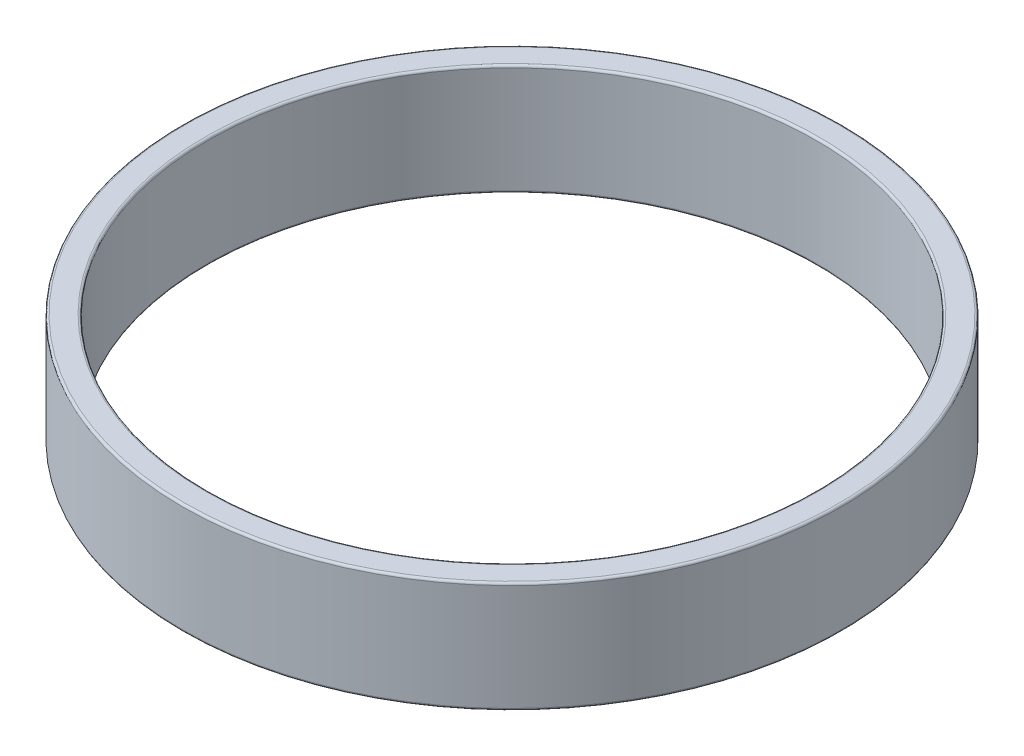
ISO-10303-21;
HEADER;
FILE_DESCRIPTION(('STEP AP214'),'2;1');
FILE_NAME('part.step','',(''),(''),'','','');
FILE_SCHEMA(('AUTOMOTIVE_DESIGN { 1 0 10303 214 1 1 1 1 }'));
ENDSEC;
DATA;
#1=APPLICATION_CONTEXT('core data for automotive mechanical design processes');
#2=APPLICATION_PROTOCOL_DEFINITION('international standard','automotive_design',2000,#1);
#3=PRODUCT_CONTEXT('',#1,'mechanical');
#4=PRODUCT('Part','Part','',(#3));
#5=PRODUCT_RELATED_PRODUCT_CATEGORY('part','',(#4));
#6=PRODUCT_DEFINITION_FORMATION('','',#4);
#7=PRODUCT_DEFINITION_CONTEXT('part definition',#1,'design');
#8=PRODUCT_DEFINITION('design','',#6,#7);
#9=PRODUCT_DEFINITION_SHAPE('','',#8);
#10=(LENGTH_UNIT() NAMED_UNIT(*) SI_UNIT(.MILLI.,.METRE.));
#11=(NAMED_UNIT(*) PLANE_ANGLE_UNIT() SI_UNIT($,.RADIAN.));
#12=(NAMED_UNIT(*) SI_UNIT($,.STERADIAN.) SOLID_ANGLE_UNIT());
#13=UNCERTAINTY_MEASURE_WITH_UNIT(LENGTH_MEASURE(1.E-05),#10,'distance_accuracy_value','');
#14=(GEOMETRIC_REPRESENTATION_CONTEXT(3) GLOBAL_UNCERTAINTY_ASSIGNED_CONTEXT((#13)) GLOBAL_UNIT_ASSIGNED_CONTEXT((#10,
#11,#12)) REPRESENTATION_CONTEXT('',''));
#15=CARTESIAN_POINT('',(0.,0.,0.));
#16=DIRECTION('',(0.,0.,1.));
#17=DIRECTION('',(1.,0.,0.));
#18=AXIS2_PLACEMENT_3D('',#15,#16,#17);
#19=CARTESIAN_POINT('',(0.,25.4,0.));
#20=DIRECTION('',(0.,1.,0.));
#21=DIRECTION('',(0.,0.,1.));
#22=AXIS2_PLACEMENT_3D('',#19,#20,#21);
#23=PLANE('',#22);
#24=CARTESIAN_POINT('',(0.,25.4,0.));
#25=DIRECTION('',(0.,1.,0.));
#26=DIRECTION('',(0.,0.,1.));
#27=AXIS2_PLACEMENT_3D('',#24,#25,#26);
#28=CIRCLE('',#27,70.358);
#29=CARTESIAN_POINT('',(0.,25.4,70.358));
#30=VERTEX_POINT('',#29);
#31=EDGE_CURVE('E42',#30,#30,#28,.F.);
#32=ORIENTED_EDGE('',*,*,#31,.T.);
#33=EDGE_LOOP('',(#32));
#34=FACE_BOUND('',#33,.T.);
#35=CARTESIAN_POINT('',(0.,25.4,0.));
#36=DIRECTION('',(0.,1.,0.));
#37=DIRECTION('',(0.,0.,1.));
#38=AXIS2_PLACEMENT_3D('',#35,#36,#37);
#39=CIRCLE('',#38,75.057);
#40=CARTESIAN_POINT('',(0.,25.4,75.057));
#41=VERTEX_POINT('',#40);
#42=EDGE_CURVE('E46',#41,#41,#39,.T.);
#43=ORIENTED_EDGE('',*,*,#42,.T.);
#44=EDGE_LOOP('',(#43));
#45=FACE_BOUND('',#44,.T.);
#46=ADVANCED_FACE('F31',(#34,#45),#23,.T.);
#47=CARTESIAN_POINT('',(0.,0.,0.));
#48=DIRECTION('',(0.,1.,0.));
#49=DIRECTION('',(0.,0.,1.));
#50=AXIS2_PLACEMENT_3D('',#47,#48,#49);
#51=PLANE('',#50);
#52=CARTESIAN_POINT('',(0.,0.,0.));
#53=DIRECTION('',(0.,1.,0.));
#54=DIRECTION('',(0.,0.,1.));
#55=AXIS2_PLACEMENT_3D('',#52,#53,#54);
#56=CIRCLE('',#55,70.358);
#57=CARTESIAN_POINT('',(0.,0.,70.358));
#58=VERTEX_POINT('',#57);
#59=EDGE_CURVE('E57',#58,#58,#56,.T.);
#60=ORIENTED_EDGE('',*,*,#59,.T.);
#61=EDGE_LOOP('',(#60));
#62=FACE_BOUND('',#61,.T.);
#63=CARTESIAN_POINT('',(0.,0.,0.));
#64=DIRECTION('',(0.,1.,0.));
#65=DIRECTION('',(0.,0.,1.));
#66=AXIS2_PLACEMENT_3D('',#63,#64,#65);
#67=CIRCLE('',#66,75.057);
#68=CARTESIAN_POINT('',(0.,0.,75.057));
#69=VERTEX_POINT('',#68);
#70=EDGE_CURVE('E60',#69,#69,#67,.F.);
#71=ORIENTED_EDGE('',*,*,#70,.T.);
#72=EDGE_LOOP('',(#71));
#73=FACE_BOUND('',#72,.T.);
#74=ADVANCED_FACE('F64',(#62,#73),#51,.F.);
#75=CARTESIAN_POINT('',(0.,25.4,0.));
#76=DIRECTION('',(0.,-1.,0.));
#77=DIRECTION('',(0.,0.,-1.));
#78=AXIS2_PLACEMENT_3D('',#75,#76,#77);
#79=CYLINDRICAL_SURFACE('',#78,75.565);
#80=CARTESIAN_POINT('',(0.,0.508000000000002,0.));
#81=DIRECTION('',(0.,1.,0.));
#82=DIRECTION('',(0.,0.,1.));
#83=AXIS2_PLACEMENT_3D('',#80,#81,#82);
#84=CIRCLE('',#83,75.565);
#85=CARTESIAN_POINT('',(0.,0.508000000000002,75.565));
#86=VERTEX_POINT('',#85);
#87=EDGE_CURVE('E10',#86,#86,#84,.T.);
#88=ORIENTED_EDGE('',*,*,#87,.T.);
#89=EDGE_LOOP('',(#88));
#90=FACE_BOUND('',#89,.T.);
#91=CARTESIAN_POINT('',(0.,24.892,0.));
#92=DIRECTION('',(0.,1.,0.));
#93=DIRECTION('',(0.,0.,1.));
#94=AXIS2_PLACEMENT_3D('',#91,#92,#93);
#95=CIRCLE('',#94,75.565);
#96=CARTESIAN_POINT('',(0.,24.892,75.565));
#97=VERTEX_POINT('',#96);
#98=EDGE_CURVE('E38',#97,#97,#95,.F.);
#99=ORIENTED_EDGE('',*,*,#98,.T.);
#100=EDGE_LOOP('',(#99));
#101=FACE_BOUND('',#100,.T.);
#102=ADVANCED_FACE('F84',(#90,#101),#79,.T.);
#103=CARTESIAN_POINT('',(0.,25.4,0.));
#104=DIRECTION('',(0.,-1.,0.));
#105=DIRECTION('',(0.,0.,-1.));
#106=AXIS2_PLACEMENT_3D('',#103,#104,#105);
#107=CYLINDRICAL_SURFACE('',#106,69.85);
#108=CARTESIAN_POINT('',(0.,0.508000000000002,0.));
#109=DIRECTION('',(0.,1.,0.));
#110=DIRECTION('',(0.,0.,1.));
#111=AXIS2_PLACEMENT_3D('',#108,#109,#110);
#112=CIRCLE('',#111,69.85);
#113=CARTESIAN_POINT('',(0.,0.508000000000002,69.85));
#114=VERTEX_POINT('',#113);
#115=EDGE_CURVE('E51',#114,#114,#112,.F.);
#116=ORIENTED_EDGE('',*,*,#115,.T.);
#117=EDGE_LOOP('',(#116));
#118=FACE_BOUND('',#117,.T.);
#119=CARTESIAN_POINT('',(0.,24.892,0.));
#120=DIRECTION('',(0.,1.,0.));
#121=DIRECTION('',(0.,0.,1.));
#122=AXIS2_PLACEMENT_3D('',#119,#120,#121);
#123=CIRCLE('',#122,69.85);
#124=CARTESIAN_POINT('',(0.,24.892,69.85));
#125=VERTEX_POINT('',#124);
#126=EDGE_CURVE('E54',#125,#125,#123,.T.);
#127=ORIENTED_EDGE('',*,*,#126,.T.);
#128=EDGE_LOOP('',(#127));
#129=FACE_BOUND('',#128,.T.);
#130=ADVANCED_FACE('F89',(#118,#129),#107,.F.);
#131=CARTESIAN_POINT('',(0.,0.508000000000002,0.));
#132=DIRECTION('',(0.,1.,0.));
#133=DIRECTION('',(0.,0.,1.));
#134=AXIS2_PLACEMENT_3D('',#131,#132,#133);
#135=TOROIDAL_SURFACE('',#134,70.358,0.508);
#136=ORIENTED_EDGE('',*,*,#115,.F.);
#137=EDGE_LOOP('',(#136));
#138=FACE_BOUND('',#137,.T.);
#139=ORIENTED_EDGE('',*,*,#59,.F.);
#140=EDGE_LOOP('',(#139));
#141=FACE_BOUND('',#140,.T.);
#142=ADVANCED_FACE('F75',(#138,#141),#135,.T.);
#143=CARTESIAN_POINT('',(0.,24.892,0.));
#144=DIRECTION('',(0.,1.,0.));
#145=DIRECTION('',(0.,0.,1.));
#146=AXIS2_PLACEMENT_3D('',#143,#144,#145);
#147=TOROIDAL_SURFACE('',#146,70.358,0.508);
#148=ORIENTED_EDGE('',*,*,#31,.F.);
#149=EDGE_LOOP('',(#148));
#150=FACE_BOUND('',#149,.T.);
#151=ORIENTED_EDGE('',*,*,#126,.F.);
#152=EDGE_LOOP('',(#151));
#153=FACE_BOUND('',#152,.T.);
#154=ADVANCED_FACE('F69',(#150,#153),#147,.T.);
#155=CARTESIAN_POINT('',(0.,0.508000000000002,0.));
#156=DIRECTION('',(0.,1.,0.));
#157=DIRECTION('',(0.,0.,1.));
#158=AXIS2_PLACEMENT_3D('',#155,#156,#157);
#159=TOROIDAL_SURFACE('',#158,75.057,0.508);
#160=ORIENTED_EDGE('',*,*,#70,.F.);
#161=EDGE_LOOP('',(#160));
#162=FACE_BOUND('',#161,.T.);
#163=ORIENTED_EDGE('',*,*,#87,.F.);
#164=EDGE_LOOP('',(#163));
#165=FACE_BOUND('',#164,.T.);
#166=ADVANCED_FACE('F66',(#162,#165),#159,.T.);
#167=CARTESIAN_POINT('',(0.,24.892,0.));
#168=DIRECTION('',(0.,1.,0.));
#169=DIRECTION('',(0.,0.,1.));
#170=AXIS2_PLACEMENT_3D('',#167,#168,#169);
#171=TOROIDAL_SURFACE('',#170,75.057,0.508);
#172=ORIENTED_EDGE('',*,*,#98,.F.);
#173=EDGE_LOOP('',(#172));
#174=FACE_BOUND('',#173,.T.);
#175=ORIENTED_EDGE('',*,*,#42,.F.);
#176=EDGE_LOOP('',(#175));
#177=FACE_BOUND('',#176,.T.);
#178=ADVANCED_FACE('F33',(#174,#177),#171,.T.);
#179=CLOSED_SHELL('',(#46,#74,#102,#130,#142,#154,#166,#178));
#180=MANIFOLD_SOLID_BREP('B2',#179);
#181=ADVANCED_BREP_SHAPE_REPRESENTATION('',(#18,#180),#14);
#182=SHAPE_DEFINITION_REPRESENTATION(#9,#181);
ENDSEC;
END-ISO-10303-21;
